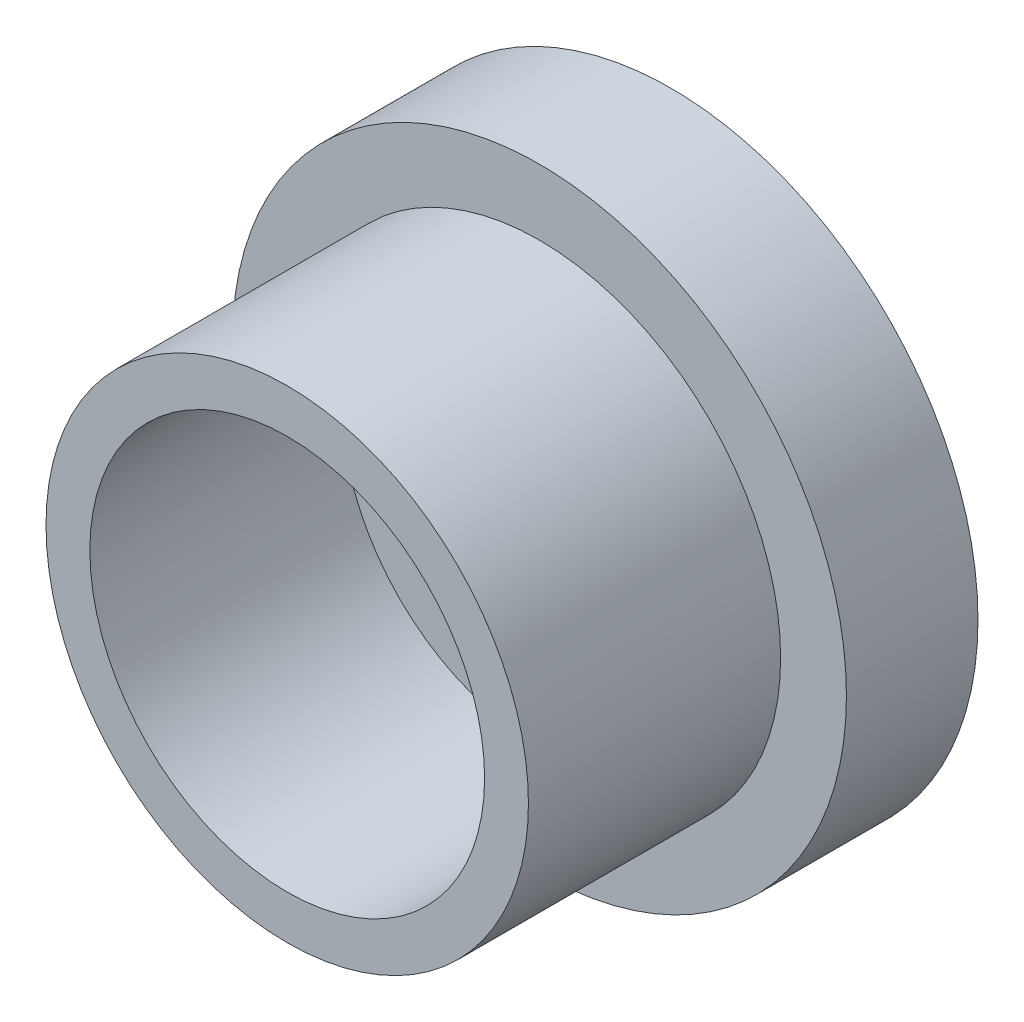
ISO-10303-21;
HEADER;
FILE_DESCRIPTION(('STEP AP214'),'2;1');
FILE_NAME('part.step','',(''),(''),'','','');
FILE_SCHEMA(('AUTOMOTIVE_DESIGN { 1 0 10303 214 1 1 1 1 }'));
ENDSEC;
DATA;
#1=APPLICATION_CONTEXT('core data for automotive mechanical design processes');
#2=APPLICATION_PROTOCOL_DEFINITION('international standard','automotive_design',2000,#1);
#3=PRODUCT_CONTEXT('',#1,'mechanical');
#4=PRODUCT('Part','Part','',(#3));
#5=PRODUCT_RELATED_PRODUCT_CATEGORY('part','',(#4));
#6=PRODUCT_DEFINITION_FORMATION('','',#4);
#7=PRODUCT_DEFINITION_CONTEXT('part definition',#1,'design');
#8=PRODUCT_DEFINITION('design','',#6,#7);
#9=PRODUCT_DEFINITION_SHAPE('','',#8);
#10=(LENGTH_UNIT() NAMED_UNIT(*) SI_UNIT(.MILLI.,.METRE.));
#11=(NAMED_UNIT(*) PLANE_ANGLE_UNIT() SI_UNIT($,.RADIAN.));
#12=(NAMED_UNIT(*) SI_UNIT($,.STERADIAN.) SOLID_ANGLE_UNIT());
#13=UNCERTAINTY_MEASURE_WITH_UNIT(LENGTH_MEASURE(1.E-05),#10,'distance_accuracy_value','');
#14=(GEOMETRIC_REPRESENTATION_CONTEXT(3) GLOBAL_UNCERTAINTY_ASSIGNED_CONTEXT((#13)) GLOBAL_UNIT_ASSIGNED_CONTEXT((#10,
#11,#12)) REPRESENTATION_CONTEXT('',''));
#15=CARTESIAN_POINT('',(0.,0.,0.));
#16=DIRECTION('',(0.,0.,1.));
#17=DIRECTION('',(1.,0.,0.));
#18=AXIS2_PLACEMENT_3D('',#15,#16,#17);
#19=CARTESIAN_POINT('',(0.,0.,3.5));
#20=DIRECTION('',(0.,0.,-1.));
#21=DIRECTION('',(-1.,0.,0.));
#22=AXIS2_PLACEMENT_3D('',#19,#20,#21);
#23=CYLINDRICAL_SURFACE('',#22,1.8);
#24=CARTESIAN_POINT('',(0.,0.,1.2));
#25=DIRECTION('',(0.,0.,1.));
#26=DIRECTION('',(1.,0.,0.));
#27=AXIS2_PLACEMENT_3D('',#24,#25,#26);
#28=CIRCLE('',#27,1.8);
#29=CARTESIAN_POINT('',(1.8,0.,1.2));
#30=VERTEX_POINT('',#29);
#31=EDGE_CURVE('E12',#30,#30,#28,.T.);
#32=ORIENTED_EDGE('',*,*,#31,.F.);
#33=EDGE_LOOP('',(#32));
#34=FACE_BOUND('',#33,.T.);
#35=CARTESIAN_POINT('',(0.,0.,3.5));
#36=DIRECTION('',(0.,0.,1.));
#37=DIRECTION('',(1.,0.,0.));
#38=AXIS2_PLACEMENT_3D('',#35,#36,#37);
#39=CIRCLE('',#38,1.8);
#40=CARTESIAN_POINT('',(1.8,0.,3.5));
#41=VERTEX_POINT('',#40);
#42=EDGE_CURVE('E58',#41,#41,#39,.T.);
#43=ORIENTED_EDGE('',*,*,#42,.T.);
#44=EDGE_LOOP('',(#43));
#45=FACE_BOUND('',#44,.T.);
#46=ADVANCED_FACE('F46',(#34,#45),#23,.F.);
#47=CARTESIAN_POINT('',(0.,0.,3.5));
#48=DIRECTION('',(0.,0.,-1.));
#49=DIRECTION('',(-1.,0.,0.));
#50=AXIS2_PLACEMENT_3D('',#47,#48,#49);
#51=CYLINDRICAL_SURFACE('',#50,2.2);
#52=CARTESIAN_POINT('',(0.,0.,1.2));
#53=DIRECTION('',(0.,0.,1.));
#54=DIRECTION('',(1.,0.,0.));
#55=AXIS2_PLACEMENT_3D('',#52,#53,#54);
#56=CIRCLE('',#55,2.2);
#57=CARTESIAN_POINT('',(2.2,0.,1.2));
#58=VERTEX_POINT('',#57);
#59=EDGE_CURVE('E49',#58,#58,#56,.T.);
#60=ORIENTED_EDGE('',*,*,#59,.T.);
#61=EDGE_LOOP('',(#60));
#62=FACE_BOUND('',#61,.T.);
#63=CARTESIAN_POINT('',(0.,0.,3.5));
#64=DIRECTION('',(0.,0.,1.));
#65=DIRECTION('',(1.,0.,0.));
#66=AXIS2_PLACEMENT_3D('',#63,#64,#65);
#67=CIRCLE('',#66,2.2);
#68=CARTESIAN_POINT('',(2.2,0.,3.5));
#69=VERTEX_POINT('',#68);
#70=EDGE_CURVE('E53',#69,#69,#67,.T.);
#71=ORIENTED_EDGE('',*,*,#70,.F.);
#72=EDGE_LOOP('',(#71));
#73=FACE_BOUND('',#72,.T.);
#74=ADVANCED_FACE('F92',(#62,#73),#51,.T.);
#75=CARTESIAN_POINT('',(0.,0.,3.5));
#76=DIRECTION('',(0.,0.,1.));
#77=DIRECTION('',(1.,0.,0.));
#78=AXIS2_PLACEMENT_3D('',#75,#76,#77);
#79=PLANE('',#78);
#80=ORIENTED_EDGE('',*,*,#42,.F.);
#81=EDGE_LOOP('',(#80));
#82=FACE_BOUND('',#81,.T.);
#83=ORIENTED_EDGE('',*,*,#70,.T.);
#84=EDGE_LOOP('',(#83));
#85=FACE_BOUND('',#84,.T.);
#86=ADVANCED_FACE('F97',(#82,#85),#79,.T.);
#87=CARTESIAN_POINT('',(0.,0.,1.2));
#88=DIRECTION('',(0.,0.,1.));
#89=DIRECTION('',(1.,0.,0.));
#90=AXIS2_PLACEMENT_3D('',#87,#88,#89);
#91=PLANE('',#90);
#92=ORIENTED_EDGE('',*,*,#59,.F.);
#93=EDGE_LOOP('',(#92));
#94=FACE_BOUND('',#93,.T.);
#95=CARTESIAN_POINT('',(0.,0.,1.2));
#96=DIRECTION('',(0.,0.,1.));
#97=DIRECTION('',(1.,0.,0.));
#98=AXIS2_PLACEMENT_3D('',#95,#96,#97);
#99=CIRCLE('',#98,2.8);
#100=CARTESIAN_POINT('',(2.8,0.,1.2));
#101=VERTEX_POINT('',#100);
#102=EDGE_CURVE('E67',#101,#101,#99,.T.);
#103=ORIENTED_EDGE('',*,*,#102,.T.);
#104=EDGE_LOOP('',(#103));
#105=FACE_BOUND('',#104,.T.);
#106=ADVANCED_FACE('F87',(#94,#105),#91,.T.);
#107=CARTESIAN_POINT('',(0.,0.,1.2));
#108=DIRECTION('',(0.,0.,-1.));
#109=DIRECTION('',(-1.,0.,0.));
#110=AXIS2_PLACEMENT_3D('',#107,#108,#109);
#111=CYLINDRICAL_SURFACE('',#110,2.8);
#112=ORIENTED_EDGE('',*,*,#102,.F.);
#113=EDGE_LOOP('',(#112));
#114=FACE_BOUND('',#113,.T.);
#115=CARTESIAN_POINT('',(0.,0.,0.));
#116=DIRECTION('',(0.,0.,1.));
#117=DIRECTION('',(1.,0.,0.));
#118=AXIS2_PLACEMENT_3D('',#115,#116,#117);
#119=CIRCLE('',#118,2.8);
#120=CARTESIAN_POINT('',(2.8,0.,0.));
#121=VERTEX_POINT('',#120);
#122=EDGE_CURVE('E61',#121,#121,#119,.T.);
#123=ORIENTED_EDGE('',*,*,#122,.T.);
#124=EDGE_LOOP('',(#123));
#125=FACE_BOUND('',#124,.T.);
#126=ADVANCED_FACE('F76',(#114,#125),#111,.T.);
#127=CARTESIAN_POINT('',(0.,0.,0.));
#128=DIRECTION('',(0.,0.,1.));
#129=DIRECTION('',(1.,0.,0.));
#130=AXIS2_PLACEMENT_3D('',#127,#128,#129);
#131=PLANE('',#130);
#132=ORIENTED_EDGE('',*,*,#122,.F.);
#133=EDGE_LOOP('',(#132));
#134=FACE_BOUND('',#133,.T.);
#135=ADVANCED_FACE('F78',(#134),#131,.F.);
#136=ORIENTED_EDGE('',*,*,#31,.T.);
#137=EDGE_LOOP('',(#136));
#138=FACE_BOUND('',#137,.T.);
#139=ADVANCED_FACE('F80',(#138),#91,.T.);
#140=CLOSED_SHELL('',(#46,#74,#86,#106,#126,#135,#139));
#141=MANIFOLD_SOLID_BREP('B2',#140);
#142=ADVANCED_BREP_SHAPE_REPRESENTATION('',(#18,#141),#14);
#143=SHAPE_DEFINITION_REPRESENTATION(#9,#142);
ENDSEC;
END-ISO-10303-21;
